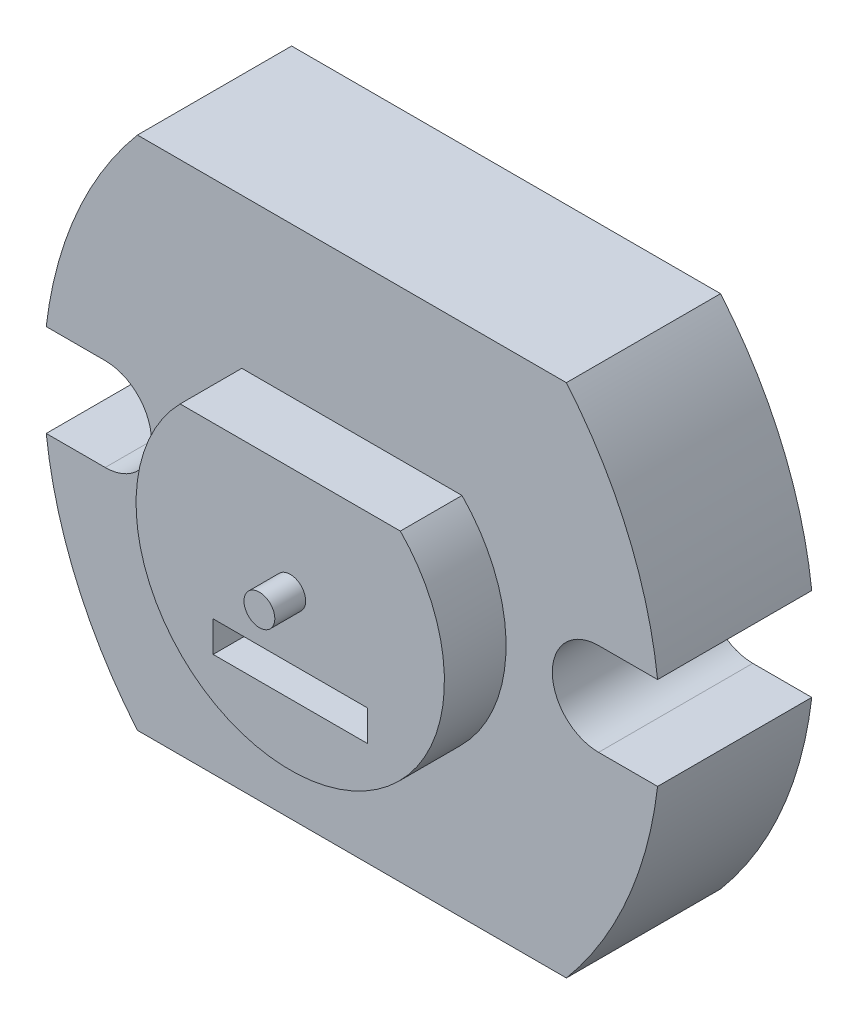
ISO-10303-21;
HEADER;
FILE_DESCRIPTION(('STEP AP214'),'2;1');
FILE_NAME('part.step','',(''),(''),'','','');
FILE_SCHEMA(('AUTOMOTIVE_DESIGN { 1 0 10303 214 1 1 1 1 }'));
ENDSEC;
DATA;
#1=APPLICATION_CONTEXT('core data for automotive mechanical design processes');
#2=APPLICATION_PROTOCOL_DEFINITION('international standard','automotive_design',2000,#1);
#3=PRODUCT_CONTEXT('',#1,'mechanical');
#4=PRODUCT('Part','Part','',(#3));
#5=PRODUCT_RELATED_PRODUCT_CATEGORY('part','',(#4));
#6=PRODUCT_DEFINITION_FORMATION('','',#4);
#7=PRODUCT_DEFINITION_CONTEXT('part definition',#1,'design');
#8=PRODUCT_DEFINITION('design','',#6,#7);
#9=PRODUCT_DEFINITION_SHAPE('','',#8);
#10=(LENGTH_UNIT() NAMED_UNIT(*) SI_UNIT(.MILLI.,.METRE.));
#11=(NAMED_UNIT(*) PLANE_ANGLE_UNIT() SI_UNIT($,.RADIAN.));
#12=(NAMED_UNIT(*) SI_UNIT($,.STERADIAN.) SOLID_ANGLE_UNIT());
#13=UNCERTAINTY_MEASURE_WITH_UNIT(LENGTH_MEASURE(1.E-05),#10,'distance_accuracy_value','');
#14=(GEOMETRIC_REPRESENTATION_CONTEXT(3) GLOBAL_UNCERTAINTY_ASSIGNED_CONTEXT((#13)) GLOBAL_UNIT_ASSIGNED_CONTEXT((#10,
#11,#12)) REPRESENTATION_CONTEXT('',''));
#15=CARTESIAN_POINT('',(0.,0.,0.));
#16=DIRECTION('',(0.,0.,1.));
#17=DIRECTION('',(1.,0.,0.));
#18=AXIS2_PLACEMENT_3D('',#15,#16,#17);
#19=CARTESIAN_POINT('',(0.,0.,5.));
#20=DIRECTION('',(0.,0.,1.));
#21=DIRECTION('',(1.,0.,0.));
#22=AXIS2_PLACEMENT_3D('',#19,#20,#21);
#23=PLANE('',#22);
#24=DIRECTION('',(1.,0.,0.));
#25=VECTOR('',#24,1.);
#26=CARTESIAN_POINT('',(-8.,-1.5,5.));
#27=LINE('',#26,#25);
#28=CARTESIAN_POINT('',(-9.91317157014496,-1.5,5.));
#29=VERTEX_POINT('',#28);
#30=CARTESIAN_POINT('',(-8.,-1.5,5.));
#31=VERTEX_POINT('',#30);
#32=EDGE_CURVE('E221',#29,#31,#27,.T.);
#33=ORIENTED_EDGE('',*,*,#32,.F.);
#34=CARTESIAN_POINT('',(3.,0.,5.));
#35=DIRECTION('',(0.,0.,1.));
#36=DIRECTION('',(1.,0.,0.));
#37=AXIS2_PLACEMENT_3D('',#34,#35,#36);
#38=CIRCLE('',#37,13.);
#39=CARTESIAN_POINT('',(-6.95542063400638,-8.36,5.));
#40=VERTEX_POINT('',#39);
#41=EDGE_CURVE('E263',#40,#29,#38,.F.);
#42=ORIENTED_EDGE('',*,*,#41,.F.);
#43=DIRECTION('',(1.,0.,0.));
#44=VECTOR('',#43,1.);
#45=CARTESIAN_POINT('',(0.,-8.36,5.));
#46=LINE('',#45,#44);
#47=CARTESIAN_POINT('',(6.95542063400638,-8.36,5.));
#48=VERTEX_POINT('',#47);
#49=EDGE_CURVE('E266',#40,#48,#46,.T.);
#50=ORIENTED_EDGE('',*,*,#49,.T.);
#51=CARTESIAN_POINT('',(-3.,0.,5.));
#52=DIRECTION('',(0.,0.,1.));
#53=DIRECTION('',(1.,0.,0.));
#54=AXIS2_PLACEMENT_3D('',#51,#52,#53);
#55=CIRCLE('',#54,13.);
#56=CARTESIAN_POINT('',(9.91317157014496,-1.5,5.));
#57=VERTEX_POINT('',#56);
#58=EDGE_CURVE('E270',#48,#57,#55,.T.);
#59=ORIENTED_EDGE('',*,*,#58,.T.);
#60=DIRECTION('',(1.,0.,0.));
#61=VECTOR('',#60,1.);
#62=CARTESIAN_POINT('',(9.91317157014496,-1.5,5.));
#63=LINE('',#62,#61);
#64=CARTESIAN_POINT('',(8.,-1.5,5.));
#65=VERTEX_POINT('',#64);
#66=EDGE_CURVE('E249',#65,#57,#63,.T.);
#67=ORIENTED_EDGE('',*,*,#66,.F.);
#68=CARTESIAN_POINT('',(8.,0.,5.));
#69=DIRECTION('',(0.,0.,1.));
#70=DIRECTION('',(-1.,0.,0.));
#71=AXIS2_PLACEMENT_3D('',#68,#69,#70);
#72=CIRCLE('',#71,1.5);
#73=CARTESIAN_POINT('',(8.,1.5,5.));
#74=VERTEX_POINT('',#73);
#75=EDGE_CURVE('E238',#74,#65,#72,.T.);
#76=ORIENTED_EDGE('',*,*,#75,.F.);
#77=DIRECTION('',(-1.,0.,0.));
#78=VECTOR('',#77,1.);
#79=CARTESIAN_POINT('',(8.,1.5,5.));
#80=LINE('',#79,#78);
#81=CARTESIAN_POINT('',(9.91317157014496,1.5,5.));
#82=VERTEX_POINT('',#81);
#83=EDGE_CURVE('E243',#82,#74,#80,.T.);
#84=ORIENTED_EDGE('',*,*,#83,.F.);
#85=CARTESIAN_POINT('',(6.95542063400638,8.36,5.));
#86=VERTEX_POINT('',#85);
#87=EDGE_CURVE('E269',#82,#86,#55,.T.);
#88=ORIENTED_EDGE('',*,*,#87,.T.);
#89=DIRECTION('',(1.,0.,0.));
#90=VECTOR('',#89,1.);
#91=CARTESIAN_POINT('',(0.,8.36,5.));
#92=LINE('',#91,#90);
#93=CARTESIAN_POINT('',(-6.95542063400638,8.36,5.));
#94=VERTEX_POINT('',#93);
#95=EDGE_CURVE('E273',#94,#86,#92,.T.);
#96=ORIENTED_EDGE('',*,*,#95,.F.);
#97=CARTESIAN_POINT('',(-9.91317157014496,1.5,5.));
#98=VERTEX_POINT('',#97);
#99=EDGE_CURVE('E267',#98,#94,#38,.F.);
#100=ORIENTED_EDGE('',*,*,#99,.F.);
#101=DIRECTION('',(-1.,0.,0.));
#102=VECTOR('',#101,1.);
#103=CARTESIAN_POINT('',(-9.91317157014496,1.5,5.));
#104=LINE('',#103,#102);
#105=CARTESIAN_POINT('',(-8.,1.5,5.));
#106=VERTEX_POINT('',#105);
#107=EDGE_CURVE('E227',#106,#98,#104,.T.);
#108=ORIENTED_EDGE('',*,*,#107,.F.);
#109=CARTESIAN_POINT('',(-8.,0.,5.));
#110=DIRECTION('',(0.,0.,1.));
#111=DIRECTION('',(1.,0.,0.));
#112=AXIS2_PLACEMENT_3D('',#109,#110,#111);
#113=CIRCLE('',#112,1.5);
#114=EDGE_CURVE('E216',#31,#106,#113,.T.);
#115=ORIENTED_EDGE('',*,*,#114,.F.);
#116=EDGE_LOOP('',(#33,#42,#50,#59,#67,#76,#84,#88,#96,#100,#108,#115));
#117=FACE_BOUND('',#116,.T.);
#118=DIRECTION('',(-1.,0.,0.));
#119=VECTOR('',#118,1.);
#120=CARTESIAN_POINT('',(-3.57071421427143,3.5,5.));
#121=LINE('',#120,#119);
#122=CARTESIAN_POINT('',(3.57071421427143,3.5,5.));
#123=VERTEX_POINT('',#122);
#124=CARTESIAN_POINT('',(-3.57071421427143,3.5,5.));
#125=VERTEX_POINT('',#124);
#126=EDGE_CURVE('E205',#123,#125,#121,.T.);
#127=ORIENTED_EDGE('',*,*,#126,.F.);
#128=CARTESIAN_POINT('',(0.,0.,5.));
#129=DIRECTION('',(0.,0.,1.));
#130=DIRECTION('',(1.,0.,0.));
#131=AXIS2_PLACEMENT_3D('',#128,#129,#130);
#132=CIRCLE('',#131,5.);
#133=EDGE_CURVE('E59',#125,#123,#132,.T.);
#134=ORIENTED_EDGE('',*,*,#133,.F.);
#135=EDGE_LOOP('',(#127,#134));
#136=FACE_BOUND('',#135,.T.);
#137=ADVANCED_FACE('F35',(#117,#136),#23,.T.);
#138=CARTESIAN_POINT('',(3.,0.,5.));
#139=DIRECTION('',(0.,0.,-1.));
#140=DIRECTION('',(-1.,0.,0.));
#141=AXIS2_PLACEMENT_3D('',#138,#139,#140);
#142=CYLINDRICAL_SURFACE('',#141,13.);
#143=DIRECTION('',(0.,0.,-1.));
#144=VECTOR('',#143,1.);
#145=CARTESIAN_POINT('',(-9.91317157014496,-1.5,5.));
#146=LINE('',#145,#144);
#147=CARTESIAN_POINT('',(-9.91317157014496,-1.5,0.));
#148=VERTEX_POINT('',#147);
#149=EDGE_CURVE('E236',#148,#29,#146,.F.);
#150=ORIENTED_EDGE('',*,*,#149,.F.);
#151=CARTESIAN_POINT('',(3.,0.,0.));
#152=DIRECTION('',(0.,0.,1.));
#153=DIRECTION('',(1.,0.,0.));
#154=AXIS2_PLACEMENT_3D('',#151,#152,#153);
#155=CIRCLE('',#154,13.);
#156=CARTESIAN_POINT('',(-6.95542063400638,-8.36,0.));
#157=VERTEX_POINT('',#156);
#158=EDGE_CURVE('E277',#157,#148,#155,.F.);
#159=ORIENTED_EDGE('',*,*,#158,.F.);
#160=DIRECTION('',(0.,0.,-1.));
#161=VECTOR('',#160,1.);
#162=CARTESIAN_POINT('',(-6.95542063400638,-8.36,5.));
#163=LINE('',#162,#161);
#164=EDGE_CURVE('E297',#40,#157,#163,.T.);
#165=ORIENTED_EDGE('',*,*,#164,.F.);
#166=ORIENTED_EDGE('',*,*,#41,.T.);
#167=EDGE_LOOP('',(#150,#159,#165,#166));
#168=FACE_BOUND('',#167,.T.);
#169=ADVANCED_FACE('F336',(#168),#142,.T.);
#170=CARTESIAN_POINT('',(-3.,0.,5.));
#171=DIRECTION('',(0.,0.,-1.));
#172=DIRECTION('',(-1.,0.,0.));
#173=AXIS2_PLACEMENT_3D('',#170,#171,#172);
#174=CYLINDRICAL_SURFACE('',#173,13.);
#175=ORIENTED_EDGE('',*,*,#87,.F.);
#176=DIRECTION('',(0.,0.,-1.));
#177=VECTOR('',#176,1.);
#178=CARTESIAN_POINT('',(9.91317157014496,1.5,5.));
#179=LINE('',#178,#177);
#180=CARTESIAN_POINT('',(9.91317157014496,1.5,0.));
#181=VERTEX_POINT('',#180);
#182=EDGE_CURVE('E259',#82,#181,#179,.T.);
#183=ORIENTED_EDGE('',*,*,#182,.T.);
#184=CARTESIAN_POINT('',(-3.,0.,0.));
#185=DIRECTION('',(0.,0.,1.));
#186=DIRECTION('',(1.,0.,0.));
#187=AXIS2_PLACEMENT_3D('',#184,#185,#186);
#188=CIRCLE('',#187,13.);
#189=CARTESIAN_POINT('',(6.95542063400638,8.36,0.));
#190=VERTEX_POINT('',#189);
#191=EDGE_CURVE('E282',#181,#190,#188,.T.);
#192=ORIENTED_EDGE('',*,*,#191,.T.);
#193=DIRECTION('',(0.,0.,-1.));
#194=VECTOR('',#193,1.);
#195=CARTESIAN_POINT('',(6.95542063400638,8.36,5.));
#196=LINE('',#195,#194);
#197=EDGE_CURVE('E291',#86,#190,#196,.T.);
#198=ORIENTED_EDGE('',*,*,#197,.F.);
#199=EDGE_LOOP('',(#175,#183,#192,#198));
#200=FACE_BOUND('',#199,.T.);
#201=ADVANCED_FACE('F309',(#200),#174,.T.);
#202=DIRECTION('',(0.,0.,-1.));
#203=VECTOR('',#202,1.);
#204=CARTESIAN_POINT('',(-9.91317157014496,1.5,5.));
#205=LINE('',#204,#203);
#206=CARTESIAN_POINT('',(-9.91317157014496,1.5,0.));
#207=VERTEX_POINT('',#206);
#208=EDGE_CURVE('E233',#98,#207,#205,.T.);
#209=ORIENTED_EDGE('',*,*,#208,.F.);
#210=ORIENTED_EDGE('',*,*,#99,.T.);
#211=DIRECTION('',(0.,0.,-1.));
#212=VECTOR('',#211,1.);
#213=CARTESIAN_POINT('',(-6.95542063400638,8.36,5.));
#214=LINE('',#213,#212);
#215=CARTESIAN_POINT('',(-6.95542063400638,8.36,0.));
#216=VERTEX_POINT('',#215);
#217=EDGE_CURVE('E276',#94,#216,#214,.T.);
#218=ORIENTED_EDGE('',*,*,#217,.T.);
#219=EDGE_CURVE('E262',#207,#216,#155,.F.);
#220=ORIENTED_EDGE('',*,*,#219,.F.);
#221=EDGE_LOOP('',(#209,#210,#218,#220));
#222=FACE_BOUND('',#221,.T.);
#223=ADVANCED_FACE('F37',(#222),#142,.T.);
#224=CARTESIAN_POINT('',(0.,-8.36,5.));
#225=DIRECTION('',(0.,1.,0.));
#226=DIRECTION('',(-1.,0.,0.));
#227=AXIS2_PLACEMENT_3D('',#224,#225,#226);
#228=PLANE('',#227);
#229=DIRECTION('',(1.,0.,0.));
#230=VECTOR('',#229,1.);
#231=CARTESIAN_POINT('',(0.,-8.36,0.));
#232=LINE('',#231,#230);
#233=CARTESIAN_POINT('',(6.95542063400638,-8.36,0.));
#234=VERTEX_POINT('',#233);
#235=EDGE_CURVE('E280',#157,#234,#232,.T.);
#236=ORIENTED_EDGE('',*,*,#235,.T.);
#237=DIRECTION('',(0.,0.,-1.));
#238=VECTOR('',#237,1.);
#239=CARTESIAN_POINT('',(6.95542063400638,-8.36,5.));
#240=LINE('',#239,#238);
#241=EDGE_CURVE('E294',#48,#234,#240,.T.);
#242=ORIENTED_EDGE('',*,*,#241,.F.);
#243=ORIENTED_EDGE('',*,*,#49,.F.);
#244=ORIENTED_EDGE('',*,*,#164,.T.);
#245=EDGE_LOOP('',(#236,#242,#243,#244));
#246=FACE_BOUND('',#245,.T.);
#247=ADVANCED_FACE('F331',(#246),#228,.F.);
#248=CARTESIAN_POINT('',(9.91317157014496,-1.5,0.));
#249=VERTEX_POINT('',#248);
#250=EDGE_CURVE('E283',#234,#249,#188,.T.);
#251=ORIENTED_EDGE('',*,*,#250,.T.);
#252=DIRECTION('',(0.,0.,-1.));
#253=VECTOR('',#252,1.);
#254=CARTESIAN_POINT('',(9.91317157014496,-1.5,5.));
#255=LINE('',#254,#253);
#256=EDGE_CURVE('E255',#249,#57,#255,.F.);
#257=ORIENTED_EDGE('',*,*,#256,.T.);
#258=ORIENTED_EDGE('',*,*,#58,.F.);
#259=ORIENTED_EDGE('',*,*,#241,.T.);
#260=EDGE_LOOP('',(#251,#257,#258,#259));
#261=FACE_BOUND('',#260,.T.);
#262=ADVANCED_FACE('F326',(#261),#174,.T.);
#263=CARTESIAN_POINT('',(0.,8.36,5.));
#264=DIRECTION('',(0.,1.,0.));
#265=DIRECTION('',(-1.,0.,0.));
#266=AXIS2_PLACEMENT_3D('',#263,#264,#265);
#267=PLANE('',#266);
#268=DIRECTION('',(1.,0.,0.));
#269=VECTOR('',#268,1.);
#270=CARTESIAN_POINT('',(0.,8.36,0.));
#271=LINE('',#270,#269);
#272=EDGE_CURVE('E286',#216,#190,#271,.T.);
#273=ORIENTED_EDGE('',*,*,#272,.F.);
#274=ORIENTED_EDGE('',*,*,#217,.F.);
#275=ORIENTED_EDGE('',*,*,#95,.T.);
#276=ORIENTED_EDGE('',*,*,#197,.T.);
#277=EDGE_LOOP('',(#273,#274,#275,#276));
#278=FACE_BOUND('',#277,.T.);
#279=ADVANCED_FACE('F352',(#278),#267,.T.);
#280=CARTESIAN_POINT('',(0.,0.,0.));
#281=DIRECTION('',(0.,0.,1.));
#282=DIRECTION('',(1.,0.,0.));
#283=AXIS2_PLACEMENT_3D('',#280,#281,#282);
#284=PLANE('',#283);
#285=ORIENTED_EDGE('',*,*,#158,.T.);
#286=DIRECTION('',(1.,0.,0.));
#287=VECTOR('',#286,1.);
#288=CARTESIAN_POINT('',(0.,-1.5,0.));
#289=LINE('',#288,#287);
#290=CARTESIAN_POINT('',(-8.,-1.5,0.));
#291=VERTEX_POINT('',#290);
#292=EDGE_CURVE('E11',#148,#291,#289,.T.);
#293=ORIENTED_EDGE('',*,*,#292,.T.);
#294=CARTESIAN_POINT('',(-8.,0.,0.));
#295=DIRECTION('',(0.,0.,1.));
#296=DIRECTION('',(1.,0.,0.));
#297=AXIS2_PLACEMENT_3D('',#294,#295,#296);
#298=CIRCLE('',#297,1.5);
#299=CARTESIAN_POINT('',(-8.,1.5,0.));
#300=VERTEX_POINT('',#299);
#301=EDGE_CURVE('E217',#291,#300,#298,.T.);
#302=ORIENTED_EDGE('',*,*,#301,.T.);
#303=DIRECTION('',(-1.,0.,0.));
#304=VECTOR('',#303,1.);
#305=CARTESIAN_POINT('',(-8.,1.5,0.));
#306=LINE('',#305,#304);
#307=EDGE_CURVE('E220',#300,#207,#306,.T.);
#308=ORIENTED_EDGE('',*,*,#307,.T.);
#309=ORIENTED_EDGE('',*,*,#219,.T.);
#310=ORIENTED_EDGE('',*,*,#272,.T.);
#311=ORIENTED_EDGE('',*,*,#191,.F.);
#312=DIRECTION('',(-1.,0.,0.));
#313=VECTOR('',#312,1.);
#314=CARTESIAN_POINT('',(0.,1.5,0.));
#315=LINE('',#314,#313);
#316=CARTESIAN_POINT('',(8.,1.5,0.));
#317=VERTEX_POINT('',#316);
#318=EDGE_CURVE('E44',#181,#317,#315,.T.);
#319=ORIENTED_EDGE('',*,*,#318,.T.);
#320=CARTESIAN_POINT('',(8.,0.,0.));
#321=DIRECTION('',(0.,0.,1.));
#322=DIRECTION('',(-1.,0.,0.));
#323=AXIS2_PLACEMENT_3D('',#320,#321,#322);
#324=CIRCLE('',#323,1.5);
#325=CARTESIAN_POINT('',(8.,-1.5,0.));
#326=VERTEX_POINT('',#325);
#327=EDGE_CURVE('E239',#317,#326,#324,.T.);
#328=ORIENTED_EDGE('',*,*,#327,.T.);
#329=DIRECTION('',(1.,0.,0.));
#330=VECTOR('',#329,1.);
#331=CARTESIAN_POINT('',(8.,-1.5,0.));
#332=LINE('',#331,#330);
#333=EDGE_CURVE('E242',#326,#249,#332,.T.);
#334=ORIENTED_EDGE('',*,*,#333,.T.);
#335=ORIENTED_EDGE('',*,*,#250,.F.);
#336=ORIENTED_EDGE('',*,*,#235,.F.);
#337=EDGE_LOOP('',(#285,#293,#302,#308,#309,#310,#311,#319,#328,#334,#335,#336));
#338=FACE_BOUND('',#337,.T.);
#339=ADVANCED_FACE('F302',(#338),#284,.F.);
#340=CARTESIAN_POINT('',(8.,1.5,0.));
#341=DIRECTION('',(0.,1.,0.));
#342=DIRECTION('',(0.,0.,1.));
#343=AXIS2_PLACEMENT_3D('',#340,#341,#342);
#344=PLANE('',#343);
#345=ORIENTED_EDGE('',*,*,#83,.T.);
#346=DIRECTION('',(0.,0.,1.));
#347=VECTOR('',#346,1.);
#348=CARTESIAN_POINT('',(8.,1.5,0.));
#349=LINE('',#348,#347);
#350=EDGE_CURVE('E252',#317,#74,#349,.T.);
#351=ORIENTED_EDGE('',*,*,#350,.F.);
#352=ORIENTED_EDGE('',*,*,#318,.F.);
#353=ORIENTED_EDGE('',*,*,#182,.F.);
#354=EDGE_LOOP('',(#345,#351,#352,#353));
#355=FACE_BOUND('',#354,.T.);
#356=ADVANCED_FACE('F305',(#355),#344,.F.);
#357=CARTESIAN_POINT('',(9.91317157014496,-1.5,0.));
#358=DIRECTION('',(0.,-1.,0.));
#359=DIRECTION('',(0.,0.,-1.));
#360=AXIS2_PLACEMENT_3D('',#357,#358,#359);
#361=PLANE('',#360);
#362=ORIENTED_EDGE('',*,*,#333,.F.);
#363=DIRECTION('',(0.,0.,1.));
#364=VECTOR('',#363,1.);
#365=CARTESIAN_POINT('',(8.,-1.5,0.));
#366=LINE('',#365,#364);
#367=EDGE_CURVE('E246',#326,#65,#366,.T.);
#368=ORIENTED_EDGE('',*,*,#367,.T.);
#369=ORIENTED_EDGE('',*,*,#66,.T.);
#370=ORIENTED_EDGE('',*,*,#256,.F.);
#371=EDGE_LOOP('',(#362,#368,#369,#370));
#372=FACE_BOUND('',#371,.T.);
#373=ADVANCED_FACE('F322',(#372),#361,.F.);
#374=CARTESIAN_POINT('',(8.,0.,0.));
#375=DIRECTION('',(0.,0.,1.));
#376=DIRECTION('',(1.,0.,0.));
#377=AXIS2_PLACEMENT_3D('',#374,#375,#376);
#378=CYLINDRICAL_SURFACE('',#377,1.5);
#379=ORIENTED_EDGE('',*,*,#75,.T.);
#380=ORIENTED_EDGE('',*,*,#367,.F.);
#381=ORIENTED_EDGE('',*,*,#327,.F.);
#382=ORIENTED_EDGE('',*,*,#350,.T.);
#383=EDGE_LOOP('',(#379,#380,#381,#382));
#384=FACE_BOUND('',#383,.T.);
#385=ADVANCED_FACE('F319',(#384),#378,.F.);
#386=CARTESIAN_POINT('',(-8.,0.,0.));
#387=DIRECTION('',(0.,0.,1.));
#388=DIRECTION('',(1.,0.,0.));
#389=AXIS2_PLACEMENT_3D('',#386,#387,#388);
#390=CYLINDRICAL_SURFACE('',#389,1.5);
#391=ORIENTED_EDGE('',*,*,#114,.T.);
#392=DIRECTION('',(0.,0.,1.));
#393=VECTOR('',#392,1.);
#394=CARTESIAN_POINT('',(-8.,1.5,0.));
#395=LINE('',#394,#393);
#396=EDGE_CURVE('E224',#300,#106,#395,.T.);
#397=ORIENTED_EDGE('',*,*,#396,.F.);
#398=ORIENTED_EDGE('',*,*,#301,.F.);
#399=DIRECTION('',(0.,0.,1.));
#400=VECTOR('',#399,1.);
#401=CARTESIAN_POINT('',(-8.,-1.5,0.));
#402=LINE('',#401,#400);
#403=EDGE_CURVE('E230',#291,#31,#402,.T.);
#404=ORIENTED_EDGE('',*,*,#403,.T.);
#405=EDGE_LOOP('',(#391,#397,#398,#404));
#406=FACE_BOUND('',#405,.T.);
#407=ADVANCED_FACE('F342',(#406),#390,.F.);
#408=CARTESIAN_POINT('',(-8.,-1.5,0.));
#409=DIRECTION('',(0.,-1.,0.));
#410=DIRECTION('',(0.,0.,-1.));
#411=AXIS2_PLACEMENT_3D('',#408,#409,#410);
#412=PLANE('',#411);
#413=ORIENTED_EDGE('',*,*,#149,.T.);
#414=ORIENTED_EDGE('',*,*,#32,.T.);
#415=ORIENTED_EDGE('',*,*,#403,.F.);
#416=ORIENTED_EDGE('',*,*,#292,.F.);
#417=EDGE_LOOP('',(#413,#414,#415,#416));
#418=FACE_BOUND('',#417,.T.);
#419=ADVANCED_FACE('F338',(#418),#412,.F.);
#420=CARTESIAN_POINT('',(-9.91317157014496,1.5,0.));
#421=DIRECTION('',(0.,1.,0.));
#422=DIRECTION('',(0.,0.,1.));
#423=AXIS2_PLACEMENT_3D('',#420,#421,#422);
#424=PLANE('',#423);
#425=ORIENTED_EDGE('',*,*,#208,.T.);
#426=ORIENTED_EDGE('',*,*,#307,.F.);
#427=ORIENTED_EDGE('',*,*,#396,.T.);
#428=ORIENTED_EDGE('',*,*,#107,.T.);
#429=EDGE_LOOP('',(#425,#426,#427,#428));
#430=FACE_BOUND('',#429,.T.);
#431=ADVANCED_FACE('F375',(#430),#424,.F.);
#432=CARTESIAN_POINT('',(0.,0.,7.));
#433=DIRECTION('',(0.,0.,1.));
#434=DIRECTION('',(1.,0.,0.));
#435=AXIS2_PLACEMENT_3D('',#432,#433,#434);
#436=PLANE('',#435);
#437=DIRECTION('',(0.,-1.,0.));
#438=VECTOR('',#437,1.);
#439=CARTESIAN_POINT('',(-2.5,-2.,7.));
#440=LINE('',#439,#438);
#441=CARTESIAN_POINT('',(-2.5,-2.,7.));
#442=VERTEX_POINT('',#441);
#443=CARTESIAN_POINT('',(-2.5,-3.,7.));
#444=VERTEX_POINT('',#443);
#445=EDGE_CURVE('E51',#442,#444,#440,.T.);
#446=ORIENTED_EDGE('',*,*,#445,.F.);
#447=DIRECTION('',(-1.,0.,0.));
#448=VECTOR('',#447,1.);
#449=CARTESIAN_POINT('',(-2.5,-2.,7.));
#450=LINE('',#449,#448);
#451=CARTESIAN_POINT('',(2.5,-2.,7.));
#452=VERTEX_POINT('',#451);
#453=EDGE_CURVE('E183',#452,#442,#450,.T.);
#454=ORIENTED_EDGE('',*,*,#453,.F.);
#455=DIRECTION('',(0.,1.,0.));
#456=VECTOR('',#455,1.);
#457=CARTESIAN_POINT('',(2.5,-2.,7.));
#458=LINE('',#457,#456);
#459=CARTESIAN_POINT('',(2.5,-3.,7.));
#460=VERTEX_POINT('',#459);
#461=EDGE_CURVE('E186',#460,#452,#458,.T.);
#462=ORIENTED_EDGE('',*,*,#461,.F.);
#463=DIRECTION('',(1.,0.,0.));
#464=VECTOR('',#463,1.);
#465=CARTESIAN_POINT('',(-2.5,-3.,7.));
#466=LINE('',#465,#464);
#467=EDGE_CURVE('E192',#444,#460,#466,.T.);
#468=ORIENTED_EDGE('',*,*,#467,.F.);
#469=EDGE_LOOP('',(#446,#454,#462,#468));
#470=FACE_BOUND('',#469,.T.);
#471=CARTESIAN_POINT('',(0.,0.,7.));
#472=DIRECTION('',(0.,0.,1.));
#473=DIRECTION('',(1.,0.,0.));
#474=AXIS2_PLACEMENT_3D('',#471,#472,#473);
#475=CIRCLE('',#474,5.);
#476=CARTESIAN_POINT('',(-3.57071421427143,3.5,7.));
#477=VERTEX_POINT('',#476);
#478=CARTESIAN_POINT('',(3.57071421427143,3.5,7.));
#479=VERTEX_POINT('',#478);
#480=EDGE_CURVE('E201',#477,#479,#475,.T.);
#481=ORIENTED_EDGE('',*,*,#480,.T.);
#482=DIRECTION('',(-1.,0.,0.));
#483=VECTOR('',#482,1.);
#484=CARTESIAN_POINT('',(-3.57071421427143,3.5,7.));
#485=LINE('',#484,#483);
#486=EDGE_CURVE('E204',#479,#477,#485,.T.);
#487=ORIENTED_EDGE('',*,*,#486,.T.);
#488=EDGE_LOOP('',(#481,#487));
#489=FACE_BOUND('',#488,.T.);
#490=CARTESIAN_POINT('',(0.,0.,7.));
#491=DIRECTION('',(0.,0.,1.));
#492=DIRECTION('',(1.,0.,0.));
#493=AXIS2_PLACEMENT_3D('',#490,#491,#492);
#494=CIRCLE('',#493,0.5);
#495=CARTESIAN_POINT('',(0.5,0.,7.));
#496=VERTEX_POINT('',#495);
#497=EDGE_CURVE('E39',#496,#496,#494,.T.);
#498=ORIENTED_EDGE('',*,*,#497,.F.);
#499=EDGE_LOOP('',(#498));
#500=FACE_BOUND('',#499,.T.);
#501=ADVANCED_FACE('F378',(#470,#489,#500),#436,.T.);
#502=CARTESIAN_POINT('',(0.,0.,7.));
#503=DIRECTION('',(0.,0.,-1.));
#504=DIRECTION('',(-1.,0.,0.));
#505=AXIS2_PLACEMENT_3D('',#502,#503,#504);
#506=CYLINDRICAL_SURFACE('',#505,5.);
#507=ORIENTED_EDGE('',*,*,#133,.T.);
#508=DIRECTION('',(0.,0.,-1.));
#509=VECTOR('',#508,1.);
#510=CARTESIAN_POINT('',(3.57071421427143,3.5,7.));
#511=LINE('',#510,#509);
#512=EDGE_CURVE('E211',#479,#123,#511,.T.);
#513=ORIENTED_EDGE('',*,*,#512,.F.);
#514=ORIENTED_EDGE('',*,*,#480,.F.);
#515=DIRECTION('',(0.,0.,-1.));
#516=VECTOR('',#515,1.);
#517=CARTESIAN_POINT('',(-3.57071421427143,3.5,7.));
#518=LINE('',#517,#516);
#519=EDGE_CURVE('E207',#477,#125,#518,.T.);
#520=ORIENTED_EDGE('',*,*,#519,.T.);
#521=EDGE_LOOP('',(#507,#513,#514,#520));
#522=FACE_BOUND('',#521,.T.);
#523=ADVANCED_FACE('F390',(#522),#506,.T.);
#524=CARTESIAN_POINT('',(-3.57071421427143,3.5,7.));
#525=DIRECTION('',(0.,-1.,0.));
#526=DIRECTION('',(0.,0.,-1.));
#527=AXIS2_PLACEMENT_3D('',#524,#525,#526);
#528=PLANE('',#527);
#529=ORIENTED_EDGE('',*,*,#126,.T.);
#530=ORIENTED_EDGE('',*,*,#519,.F.);
#531=ORIENTED_EDGE('',*,*,#486,.F.);
#532=ORIENTED_EDGE('',*,*,#512,.T.);
#533=EDGE_LOOP('',(#529,#530,#531,#532));
#534=FACE_BOUND('',#533,.T.);
#535=ADVANCED_FACE('F388',(#534),#528,.F.);
#536=CARTESIAN_POINT('',(0.,0.,8.));
#537=DIRECTION('',(0.,0.,1.));
#538=DIRECTION('',(1.,0.,0.));
#539=AXIS2_PLACEMENT_3D('',#536,#537,#538);
#540=PLANE('',#539);
#541=CARTESIAN_POINT('',(0.,0.,8.));
#542=DIRECTION('',(0.,0.,1.));
#543=DIRECTION('',(1.,0.,0.));
#544=AXIS2_PLACEMENT_3D('',#541,#542,#543);
#545=CIRCLE('',#544,0.5);
#546=CARTESIAN_POINT('',(0.5,0.,8.));
#547=VERTEX_POINT('',#546);
#548=EDGE_CURVE('E213',#547,#547,#545,.T.);
#549=ORIENTED_EDGE('',*,*,#548,.T.);
#550=EDGE_LOOP('',(#549));
#551=FACE_BOUND('',#550,.T.);
#552=ADVANCED_FACE('F384',(#551),#540,.T.);
#553=CARTESIAN_POINT('',(0.,0.,8.));
#554=DIRECTION('',(0.,0.,-1.));
#555=DIRECTION('',(-1.,0.,0.));
#556=AXIS2_PLACEMENT_3D('',#553,#554,#555);
#557=CYLINDRICAL_SURFACE('',#556,0.5);
#558=ORIENTED_EDGE('',*,*,#497,.T.);
#559=EDGE_LOOP('',(#558));
#560=FACE_BOUND('',#559,.T.);
#561=ORIENTED_EDGE('',*,*,#548,.F.);
#562=EDGE_LOOP('',(#561));
#563=FACE_BOUND('',#562,.T.);
#564=ADVANCED_FACE('F381',(#560,#563),#557,.T.);
#565=CARTESIAN_POINT('',(-2.5,-2.,5.));
#566=DIRECTION('',(-1.,0.,0.));
#567=DIRECTION('',(0.,-1.,0.));
#568=AXIS2_PLACEMENT_3D('',#565,#566,#567);
#569=PLANE('',#568);
#570=ORIENTED_EDGE('',*,*,#445,.T.);
#571=DIRECTION('',(0.,0.,1.));
#572=VECTOR('',#571,1.);
#573=CARTESIAN_POINT('',(-2.5,-3.,5.));
#574=LINE('',#573,#572);
#575=CARTESIAN_POINT('',(-2.5,-3.,5.));
#576=VERTEX_POINT('',#575);
#577=EDGE_CURVE('E161',#576,#444,#574,.T.);
#578=ORIENTED_EDGE('',*,*,#577,.F.);
#579=DIRECTION('',(0.,-1.,0.));
#580=VECTOR('',#579,1.);
#581=CARTESIAN_POINT('',(-2.5,-2.,5.));
#582=LINE('',#581,#580);
#583=CARTESIAN_POINT('',(-2.5,-2.,5.));
#584=VERTEX_POINT('',#583);
#585=EDGE_CURVE('E165',#584,#576,#582,.T.);
#586=ORIENTED_EDGE('',*,*,#585,.F.);
#587=DIRECTION('',(0.,0.,1.));
#588=VECTOR('',#587,1.);
#589=CARTESIAN_POINT('',(-2.5,-2.,5.));
#590=LINE('',#589,#588);
#591=EDGE_CURVE('E196',#584,#442,#590,.T.);
#592=ORIENTED_EDGE('',*,*,#591,.T.);
#593=EDGE_LOOP('',(#570,#578,#586,#592));
#594=FACE_BOUND('',#593,.T.);
#595=ADVANCED_FACE('F163',(#594),#569,.F.);
#596=CARTESIAN_POINT('',(-2.5,-2.,5.));
#597=DIRECTION('',(0.,1.,0.));
#598=DIRECTION('',(-1.,0.,0.));
#599=AXIS2_PLACEMENT_3D('',#596,#597,#598);
#600=PLANE('',#599);
#601=ORIENTED_EDGE('',*,*,#453,.T.);
#602=ORIENTED_EDGE('',*,*,#591,.F.);
#603=DIRECTION('',(-1.,0.,0.));
#604=VECTOR('',#603,1.);
#605=CARTESIAN_POINT('',(-2.5,-2.,5.));
#606=LINE('',#605,#604);
#607=CARTESIAN_POINT('',(2.5,-2.,5.));
#608=VERTEX_POINT('',#607);
#609=EDGE_CURVE('E171',#608,#584,#606,.T.);
#610=ORIENTED_EDGE('',*,*,#609,.F.);
#611=DIRECTION('',(0.,0.,1.));
#612=VECTOR('',#611,1.);
#613=CARTESIAN_POINT('',(2.5,-2.,5.));
#614=LINE('',#613,#612);
#615=EDGE_CURVE('E198',#608,#452,#614,.T.);
#616=ORIENTED_EDGE('',*,*,#615,.T.);
#617=EDGE_LOOP('',(#601,#602,#610,#616));
#618=FACE_BOUND('',#617,.T.);
#619=ADVANCED_FACE('F401',(#618),#600,.F.);
#620=CARTESIAN_POINT('',(2.5,-2.,5.));
#621=DIRECTION('',(1.,0.,0.));
#622=DIRECTION('',(0.,1.,0.));
#623=AXIS2_PLACEMENT_3D('',#620,#621,#622);
#624=PLANE('',#623);
#625=ORIENTED_EDGE('',*,*,#461,.T.);
#626=ORIENTED_EDGE('',*,*,#615,.F.);
#627=DIRECTION('',(0.,1.,0.));
#628=VECTOR('',#627,1.);
#629=CARTESIAN_POINT('',(2.5,-2.,5.));
#630=LINE('',#629,#628);
#631=CARTESIAN_POINT('',(2.5,-3.,5.));
#632=VERTEX_POINT('',#631);
#633=EDGE_CURVE('E179',#632,#608,#630,.T.);
#634=ORIENTED_EDGE('',*,*,#633,.F.);
#635=DIRECTION('',(0.,0.,1.));
#636=VECTOR('',#635,1.);
#637=CARTESIAN_POINT('',(2.5,-3.,5.));
#638=LINE('',#637,#636);
#639=EDGE_CURVE('E170',#632,#460,#638,.T.);
#640=ORIENTED_EDGE('',*,*,#639,.T.);
#641=EDGE_LOOP('',(#625,#626,#634,#640));
#642=FACE_BOUND('',#641,.T.);
#643=ADVANCED_FACE('F404',(#642),#624,.F.);
#644=CARTESIAN_POINT('',(-2.5,-3.,5.));
#645=DIRECTION('',(0.,-1.,0.));
#646=DIRECTION('',(1.,0.,0.));
#647=AXIS2_PLACEMENT_3D('',#644,#645,#646);
#648=PLANE('',#647);
#649=ORIENTED_EDGE('',*,*,#467,.T.);
#650=ORIENTED_EDGE('',*,*,#639,.F.);
#651=DIRECTION('',(1.,0.,0.));
#652=VECTOR('',#651,1.);
#653=CARTESIAN_POINT('',(-2.5,-3.,5.));
#654=LINE('',#653,#652);
#655=EDGE_CURVE('E174',#576,#632,#654,.T.);
#656=ORIENTED_EDGE('',*,*,#655,.F.);
#657=ORIENTED_EDGE('',*,*,#577,.T.);
#658=EDGE_LOOP('',(#649,#650,#656,#657));
#659=FACE_BOUND('',#658,.T.);
#660=ADVANCED_FACE('F175',(#659),#648,.F.);
#661=CARTESIAN_POINT('',(0.,0.,5.));
#662=DIRECTION('',(0.,0.,1.));
#663=DIRECTION('',(1.,0.,0.));
#664=AXIS2_PLACEMENT_3D('',#661,#662,#663);
#665=PLANE('',#664);
#666=ORIENTED_EDGE('',*,*,#585,.T.);
#667=ORIENTED_EDGE('',*,*,#655,.T.);
#668=ORIENTED_EDGE('',*,*,#633,.T.);
#669=ORIENTED_EDGE('',*,*,#609,.T.);
#670=EDGE_LOOP('',(#666,#667,#668,#669));
#671=FACE_BOUND('',#670,.T.);
#672=ADVANCED_FACE('F181',(#671),#665,.T.);
#673=CLOSED_SHELL('',(#137,#169,#201,#223,#247,#262,#279,#339,#356,#373,#385,#407,#419,#431,
#501,#523,#535,#552,#564,#595,#619,#643,#660,#672));
#674=MANIFOLD_SOLID_BREP('B2',#673);
#675=ADVANCED_BREP_SHAPE_REPRESENTATION('',(#18,#674),#14);
#676=SHAPE_DEFINITION_REPRESENTATION(#9,#675);
ENDSEC;
END-ISO-10303-21;
